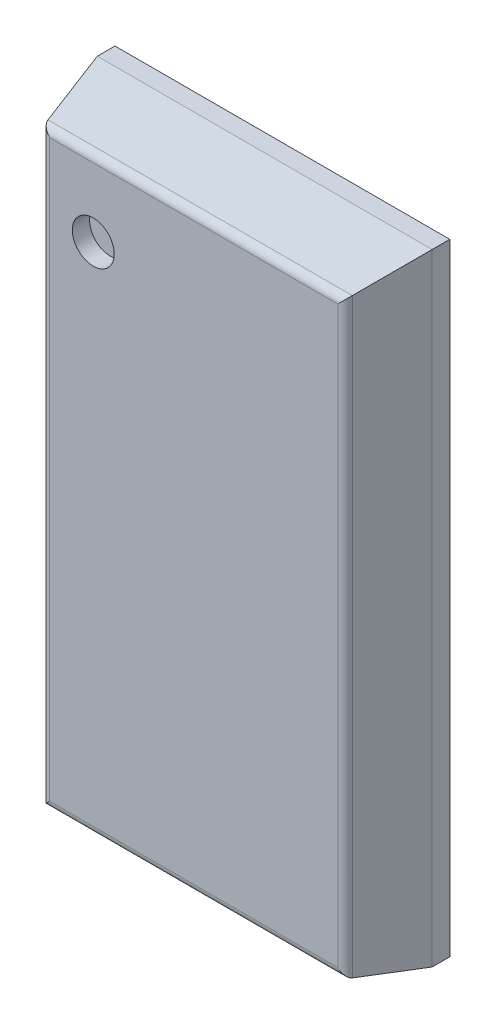
ISO-10303-21;
HEADER;
FILE_DESCRIPTION(('STEP AP214'),'2;1');
FILE_NAME('part.step','',(''),(''),'','','');
FILE_SCHEMA(('AUTOMOTIVE_DESIGN { 1 0 10303 214 1 1 1 1 }'));
ENDSEC;
DATA;
#1=APPLICATION_CONTEXT('core data for automotive mechanical design processes');
#2=APPLICATION_PROTOCOL_DEFINITION('international standard','automotive_design',2000,#1);
#3=PRODUCT_CONTEXT('',#1,'mechanical');
#4=PRODUCT('Part','Part','',(#3));
#5=PRODUCT_RELATED_PRODUCT_CATEGORY('part','',(#4));
#6=PRODUCT_DEFINITION_FORMATION('','',#4);
#7=PRODUCT_DEFINITION_CONTEXT('part definition',#1,'design');
#8=PRODUCT_DEFINITION('design','',#6,#7);
#9=PRODUCT_DEFINITION_SHAPE('','',#8);
#10=(LENGTH_UNIT() NAMED_UNIT(*) SI_UNIT(.MILLI.,.METRE.));
#11=(NAMED_UNIT(*) PLANE_ANGLE_UNIT() SI_UNIT($,.RADIAN.));
#12=(NAMED_UNIT(*) SI_UNIT($,.STERADIAN.) SOLID_ANGLE_UNIT());
#13=UNCERTAINTY_MEASURE_WITH_UNIT(LENGTH_MEASURE(1.E-05),#10,'distance_accuracy_value','');
#14=(GEOMETRIC_REPRESENTATION_CONTEXT(3) GLOBAL_UNCERTAINTY_ASSIGNED_CONTEXT((#13)) GLOBAL_UNIT_ASSIGNED_CONTEXT((#10,
#11,#12)) REPRESENTATION_CONTEXT('',''));
#15=CARTESIAN_POINT('',(0.,0.,0.));
#16=DIRECTION('',(0.,0.,1.));
#17=DIRECTION('',(1.,0.,0.));
#18=AXIS2_PLACEMENT_3D('',#15,#16,#17);
#19=CARTESIAN_POINT('',(-1.0515,2.29,1.62));
#20=DIRECTION('',(0.,0.,1.));
#21=DIRECTION('',(1.,0.,0.));
#22=AXIS2_PLACEMENT_3D('',#19,#20,#21);
#23=PLANE('',#22);
#24=CARTESIAN_POINT('',(-1.0515,2.29,1.62));
#25=DIRECTION('',(0.,0.,1.));
#26=DIRECTION('',(1.,0.,0.));
#27=AXIS2_PLACEMENT_3D('',#24,#25,#26);
#28=CIRCLE('',#27,0.2190625);
#29=CARTESIAN_POINT('',(-0.8324375,2.29,1.62));
#30=VERTEX_POINT('',#29);
#31=EDGE_CURVE('E25',#30,#30,#28,.T.);
#32=ORIENTED_EDGE('',*,*,#31,.T.);
#33=EDGE_LOOP('',(#32));
#34=FACE_BOUND('',#33,.T.);
#35=ADVANCED_FACE('F17',(#34),#23,.T.);
#36=CARTESIAN_POINT('',(-1.0515,2.29,1.62));
#37=DIRECTION('',(0.,0.,1.));
#38=DIRECTION('',(1.,0.,0.));
#39=AXIS2_PLACEMENT_3D('',#36,#37,#38);
#40=CYLINDRICAL_SURFACE('',#39,0.2190625);
#41=ORIENTED_EDGE('',*,*,#31,.F.);
#42=DIRECTION('',(0.,0.,1.));
#43=VECTOR('',#42,1.);
#44=CARTESIAN_POINT('',(-0.8324375,2.29,1.62));
#45=LINE('',#44,#43);
#46=CARTESIAN_POINT('',(-0.8324375,2.29,1.8));
#47=VERTEX_POINT('',#46);
#48=EDGE_CURVE('E11',#30,#47,#45,.T.);
#49=ORIENTED_EDGE('',*,*,#48,.T.);
#50=CARTESIAN_POINT('',(-1.0515,2.29,1.8));
#51=DIRECTION('',(0.,0.,1.));
#52=DIRECTION('',(1.,0.,0.));
#53=AXIS2_PLACEMENT_3D('',#50,#51,#52);
#54=CIRCLE('',#53,0.2190625);
#55=EDGE_CURVE('E213',#47,#47,#54,.T.);
#56=ORIENTED_EDGE('',*,*,#55,.T.);
#57=ORIENTED_EDGE('',*,*,#48,.F.);
#58=EDGE_LOOP('',(#41,#49,#56,#57));
#59=FACE_BOUND('',#58,.T.);
#60=ADVANCED_FACE('F334',(#59),#40,.F.);
#61=CARTESIAN_POINT('',(1.507884257852,-3.07725,1.712375));
#62=DIRECTION('',(0.,1.,0.));
#63=DIRECTION('',(0.,0.,1.));
#64=AXIS2_PLACEMENT_3D('',#61,#62,#63);
#65=CYLINDRICAL_SURFACE('',#64,0.087625);
#66=CARTESIAN_POINT('',(1.507884257852,-3.007884257852,1.712375));
#67=DIRECTION('',(-0.707106781186548,-0.707106781186548,0.));
#68=DIRECTION('',(0.707106781186548,-0.707106781186548,0.));
#69=AXIS2_PLACEMENT_3D('',#66,#67,#68);
#70=ELLIPSE('',#69,0.123920463403,0.087625);
#71=CARTESIAN_POINT('',(1.593170201742,-3.093170201742,1.732485902507));
#72=VERTEX_POINT('',#71);
#73=CARTESIAN_POINT('',(1.507884257852,-3.007884257852,1.8));
#74=VERTEX_POINT('',#73);
#75=EDGE_CURVE('E319',#72,#74,#70,.T.);
#76=ORIENTED_EDGE('',*,*,#75,.F.);
#77=DIRECTION('',(0.,1.,0.));
#78=VECTOR('',#77,1.);
#79=CARTESIAN_POINT('',(1.593170201742,-3.07725,1.732485902507));
#80=LINE('',#79,#78);
#81=CARTESIAN_POINT('',(1.593170201742,3.093170201742,1.732485902507));
#82=VERTEX_POINT('',#81);
#83=EDGE_CURVE('E209',#72,#82,#80,.T.);
#84=ORIENTED_EDGE('',*,*,#83,.T.);
#85=CARTESIAN_POINT('',(1.507884257852,3.007884257852,1.712375));
#86=DIRECTION('',(-0.707106781186548,0.707106781186548,0.));
#87=DIRECTION('',(0.707106781186548,0.707106781186548,0.));
#88=AXIS2_PLACEMENT_3D('',#85,#86,#87);
#89=ELLIPSE('',#88,0.123920463403,0.087625);
#90=CARTESIAN_POINT('',(1.507884257852,3.007884257852,1.8));
#91=VERTEX_POINT('',#90);
#92=EDGE_CURVE('E216',#91,#82,#89,.T.);
#93=ORIENTED_EDGE('',*,*,#92,.F.);
#94=DIRECTION('',(0.,1.,0.));
#95=VECTOR('',#94,1.);
#96=CARTESIAN_POINT('',(1.507884257852,-3.07725,1.8));
#97=LINE('',#96,#95);
#98=EDGE_CURVE('E224',#74,#91,#97,.T.);
#99=ORIENTED_EDGE('',*,*,#98,.F.);
#100=EDGE_LOOP('',(#76,#84,#93,#99));
#101=FACE_BOUND('',#100,.T.);
#102=ADVANCED_FACE('F336',(#101),#65,.T.);
#103=CARTESIAN_POINT('',(-1.57725,3.007884257852,1.712375));
#104=DIRECTION('',(1.,0.,0.));
#105=DIRECTION('',(0.,0.,1.));
#106=AXIS2_PLACEMENT_3D('',#103,#104,#105);
#107=CYLINDRICAL_SURFACE('',#106,0.087625);
#108=DIRECTION('',(1.,0.,0.));
#109=VECTOR('',#108,1.);
#110=CARTESIAN_POINT('',(-1.57725,3.007884257852,1.8));
#111=LINE('',#110,#109);
#112=CARTESIAN_POINT('',(-1.507884257852,3.007884257852,1.8));
#113=VERTEX_POINT('',#112);
#114=EDGE_CURVE('E217',#113,#91,#111,.T.);
#115=ORIENTED_EDGE('',*,*,#114,.T.);
#116=ORIENTED_EDGE('',*,*,#92,.T.);
#117=DIRECTION('',(1.,0.,0.));
#118=VECTOR('',#117,1.);
#119=CARTESIAN_POINT('',(-1.57725,3.093170201742,1.732485902507));
#120=LINE('',#119,#118);
#121=CARTESIAN_POINT('',(-1.593170201742,3.093170201742,1.732485902507));
#122=VERTEX_POINT('',#121);
#123=EDGE_CURVE('E210',#122,#82,#120,.T.);
#124=ORIENTED_EDGE('',*,*,#123,.F.);
#125=CARTESIAN_POINT('',(-1.507884257852,3.007884257852,1.712375));
#126=DIRECTION('',(0.707106781186548,0.707106781186548,0.));
#127=DIRECTION('',(-0.707106781186548,0.707106781186548,0.));
#128=AXIS2_PLACEMENT_3D('',#125,#126,#127);
#129=ELLIPSE('',#128,0.123920463403,0.087625);
#130=EDGE_CURVE('E229',#122,#113,#129,.T.);
#131=ORIENTED_EDGE('',*,*,#130,.T.);
#132=EDGE_LOOP('',(#115,#116,#124,#131));
#133=FACE_BOUND('',#132,.T.);
#134=ADVANCED_FACE('F343',(#133),#107,.T.);
#135=CARTESIAN_POINT('',(-1.7525,-3.2525,1.8));
#136=DIRECTION('',(0.,0.,1.));
#137=DIRECTION('',(1.,0.,0.));
#138=AXIS2_PLACEMENT_3D('',#135,#136,#137);
#139=PLANE('',#138);
#140=ORIENTED_EDGE('',*,*,#55,.F.);
#141=EDGE_LOOP('',(#140));
#142=FACE_BOUND('',#141,.T.);
#143=DIRECTION('',(0.,1.,0.));
#144=VECTOR('',#143,1.);
#145=CARTESIAN_POINT('',(-1.507884257852,-3.07725,1.8));
#146=LINE('',#145,#144);
#147=CARTESIAN_POINT('',(-1.507884257852,-3.007884257852,1.8));
#148=VERTEX_POINT('',#147);
#149=EDGE_CURVE('E233',#148,#113,#146,.T.);
#150=ORIENTED_EDGE('',*,*,#149,.F.);
#151=DIRECTION('',(1.,0.,0.));
#152=VECTOR('',#151,1.);
#153=CARTESIAN_POINT('',(-1.57725,-3.007884257852,1.8));
#154=LINE('',#153,#152);
#155=EDGE_CURVE('E228',#148,#74,#154,.T.);
#156=ORIENTED_EDGE('',*,*,#155,.T.);
#157=ORIENTED_EDGE('',*,*,#98,.T.);
#158=ORIENTED_EDGE('',*,*,#114,.F.);
#159=EDGE_LOOP('',(#150,#156,#157,#158));
#160=FACE_BOUND('',#159,.T.);
#161=ADVANCED_FACE('F400',(#142,#160),#139,.T.);
#162=CARTESIAN_POINT('',(-1.57725,-3.007884257852,1.712375));
#163=DIRECTION('',(1.,0.,0.));
#164=DIRECTION('',(0.,-0.973306064374652,0.229511012919918));
#165=AXIS2_PLACEMENT_3D('',#162,#163,#164);
#166=CYLINDRICAL_SURFACE('',#165,0.087625);
#167=DIRECTION('',(1.,0.,0.));
#168=VECTOR('',#167,1.);
#169=CARTESIAN_POINT('',(-1.57725,-3.093170201742,1.732485902507));
#170=LINE('',#169,#168);
#171=CARTESIAN_POINT('',(-1.593170201742,-3.093170201742,1.732485902507));
#172=VERTEX_POINT('',#171);
#173=EDGE_CURVE('E295',#172,#72,#170,.T.);
#174=ORIENTED_EDGE('',*,*,#173,.T.);
#175=ORIENTED_EDGE('',*,*,#75,.T.);
#176=ORIENTED_EDGE('',*,*,#155,.F.);
#177=CARTESIAN_POINT('',(-1.507884257852,-3.007884257852,1.712375));
#178=DIRECTION('',(-0.707106781186548,0.707106781186548,0.));
#179=DIRECTION('',(0.707106781186548,0.707106781186548,0.));
#180=AXIS2_PLACEMENT_3D('',#177,#178,#179);
#181=ELLIPSE('',#180,0.123920463403,0.087625);
#182=EDGE_CURVE('E312',#172,#148,#181,.T.);
#183=ORIENTED_EDGE('',*,*,#182,.F.);
#184=EDGE_LOOP('',(#174,#175,#176,#183));
#185=FACE_BOUND('',#184,.T.);
#186=ADVANCED_FACE('F396',(#185),#166,.T.);
#187=CARTESIAN_POINT('',(1.664875,-3.2525,1.42840151849));
#188=DIRECTION('',(0.973306064374652,0.,0.229511012919918));
#189=DIRECTION('',(0.,-1.,0.));
#190=AXIS2_PLACEMENT_3D('',#187,#188,#189);
#191=PLANE('',#190);
#192=DIRECTION('',(-0.223695018205087,0.223695018205087,0.948641701413369));
#193=VECTOR('',#192,1.);
#194=CARTESIAN_POINT('',(1.581565552085,-3.081565552085,1.781698686428));
#195=LINE('',#194,#193);
#196=CARTESIAN_POINT('',(1.7525,-3.2525,1.056803036979));
#197=VERTEX_POINT('',#196);
#198=EDGE_CURVE('E291',#197,#72,#195,.T.);
#199=ORIENTED_EDGE('',*,*,#198,.F.);
#200=DIRECTION('',(0.,1.,0.));
#201=VECTOR('',#200,1.);
#202=CARTESIAN_POINT('',(1.7525,-3.2525,1.056803036979));
#203=LINE('',#202,#201);
#204=CARTESIAN_POINT('',(1.7525,3.2525,1.056803036979));
#205=VERTEX_POINT('',#204);
#206=EDGE_CURVE('E296',#197,#205,#203,.T.);
#207=ORIENTED_EDGE('',*,*,#206,.T.);
#208=DIRECTION('',(-0.223695018205087,-0.223695018205087,0.948641701413369));
#209=VECTOR('',#208,1.);
#210=CARTESIAN_POINT('',(1.418812204631,2.918812204631,2.471900076154));
#211=LINE('',#210,#209);
#212=EDGE_CURVE('E205',#205,#82,#211,.T.);
#213=ORIENTED_EDGE('',*,*,#212,.T.);
#214=ORIENTED_EDGE('',*,*,#83,.F.);
#215=EDGE_LOOP('',(#199,#207,#213,#214));
#216=FACE_BOUND('',#215,.T.);
#217=ADVANCED_FACE('F393',(#216),#191,.T.);
#218=CARTESIAN_POINT('',(-1.7525,3.164875,1.42840151849));
#219=DIRECTION('',(0.,0.973306064374652,0.229511012919918));
#220=DIRECTION('',(1.,0.,0.));
#221=AXIS2_PLACEMENT_3D('',#218,#219,#220);
#222=PLANE('',#221);
#223=ORIENTED_EDGE('',*,*,#123,.T.);
#224=ORIENTED_EDGE('',*,*,#212,.F.);
#225=DIRECTION('',(1.,0.,0.));
#226=VECTOR('',#225,1.);
#227=CARTESIAN_POINT('',(-1.7525,3.2525,1.056803036979));
#228=LINE('',#227,#226);
#229=CARTESIAN_POINT('',(-1.7525,3.2525,1.056803036979));
#230=VERTEX_POINT('',#229);
#231=EDGE_CURVE('E259',#230,#205,#228,.T.);
#232=ORIENTED_EDGE('',*,*,#231,.F.);
#233=DIRECTION('',(0.223695018205087,-0.223695018205087,0.948641701413369));
#234=VECTOR('',#233,1.);
#235=CARTESIAN_POINT('',(-1.506506360331,3.006506360331,2.10000832043));
#236=LINE('',#235,#234);
#237=EDGE_CURVE('E290',#230,#122,#236,.T.);
#238=ORIENTED_EDGE('',*,*,#237,.T.);
#239=EDGE_LOOP('',(#223,#224,#232,#238));
#240=FACE_BOUND('',#239,.T.);
#241=ADVANCED_FACE('F391',(#240),#222,.T.);
#242=CARTESIAN_POINT('',(-1.507884257852,-3.07725,1.712375));
#243=DIRECTION('',(0.,1.,0.));
#244=DIRECTION('',(-0.973306064374652,0.,0.229511012919918));
#245=AXIS2_PLACEMENT_3D('',#242,#243,#244);
#246=CYLINDRICAL_SURFACE('',#245,0.087625);
#247=ORIENTED_EDGE('',*,*,#182,.T.);
#248=ORIENTED_EDGE('',*,*,#149,.T.);
#249=ORIENTED_EDGE('',*,*,#130,.F.);
#250=DIRECTION('',(0.,1.,0.));
#251=VECTOR('',#250,1.);
#252=CARTESIAN_POINT('',(-1.593170201742,-3.07725,1.732485902507));
#253=LINE('',#252,#251);
#254=EDGE_CURVE('E193',#172,#122,#253,.T.);
#255=ORIENTED_EDGE('',*,*,#254,.F.);
#256=EDGE_LOOP('',(#247,#248,#249,#255));
#257=FACE_BOUND('',#256,.T.);
#258=ADVANCED_FACE('F386',(#257),#246,.T.);
#259=CARTESIAN_POINT('',(-1.7525,-3.164875,1.42840151849));
#260=DIRECTION('',(0.,0.973306064374652,-0.229511012919918));
#261=DIRECTION('',(-1.,0.,0.));
#262=AXIS2_PLACEMENT_3D('',#259,#260,#261);
#263=PLANE('',#262);
#264=DIRECTION('',(0.223695018205087,0.223695018205087,0.948641701413369));
#265=VECTOR('',#264,1.);
#266=CARTESIAN_POINT('',(-1.669259707785,-3.169259707785,1.409806930703));
#267=LINE('',#266,#265);
#268=CARTESIAN_POINT('',(-1.7525,-3.2525,1.056803036979));
#269=VERTEX_POINT('',#268);
#270=EDGE_CURVE('E260',#269,#172,#267,.T.);
#271=ORIENTED_EDGE('',*,*,#270,.F.);
#272=DIRECTION('',(1.,0.,0.));
#273=VECTOR('',#272,1.);
#274=CARTESIAN_POINT('',(-1.7525,-3.2525,1.056803036979));
#275=LINE('',#274,#273);
#276=EDGE_CURVE('E147',#269,#197,#275,.T.);
#277=ORIENTED_EDGE('',*,*,#276,.T.);
#278=ORIENTED_EDGE('',*,*,#198,.T.);
#279=ORIENTED_EDGE('',*,*,#173,.F.);
#280=EDGE_LOOP('',(#271,#277,#278,#279));
#281=FACE_BOUND('',#280,.T.);
#282=ADVANCED_FACE('F365',(#281),#263,.F.);
#283=CARTESIAN_POINT('',(1.7525,-3.2525,0.74));
#284=DIRECTION('',(1.,0.,0.));
#285=DIRECTION('',(0.,1.,0.));
#286=AXIS2_PLACEMENT_3D('',#283,#284,#285);
#287=PLANE('',#286);
#288=DIRECTION('',(0.,0.,1.));
#289=VECTOR('',#288,1.);
#290=CARTESIAN_POINT('',(1.7525,-3.2525,0.74));
#291=LINE('',#290,#289);
#292=CARTESIAN_POINT('',(1.7525,-3.2525,0.871803036979));
#293=VERTEX_POINT('',#292);
#294=EDGE_CURVE('E266',#293,#197,#291,.T.);
#295=ORIENTED_EDGE('',*,*,#294,.F.);
#296=DIRECTION('',(0.,1.,0.));
#297=VECTOR('',#296,1.);
#298=CARTESIAN_POINT('',(1.7525,-3.2525,0.871803036979));
#299=LINE('',#298,#297);
#300=CARTESIAN_POINT('',(1.7525,3.2525,0.871803036979));
#301=VERTEX_POINT('',#300);
#302=EDGE_CURVE('E276',#293,#301,#299,.T.);
#303=ORIENTED_EDGE('',*,*,#302,.T.);
#304=DIRECTION('',(0.,0.,1.));
#305=VECTOR('',#304,1.);
#306=CARTESIAN_POINT('',(1.7525,3.2525,0.74));
#307=LINE('',#306,#305);
#308=EDGE_CURVE('E255',#301,#205,#307,.T.);
#309=ORIENTED_EDGE('',*,*,#308,.T.);
#310=ORIENTED_EDGE('',*,*,#206,.F.);
#311=EDGE_LOOP('',(#295,#303,#309,#310));
#312=FACE_BOUND('',#311,.T.);
#313=ADVANCED_FACE('F361',(#312),#287,.T.);
#314=CARTESIAN_POINT('',(1.547976732908,-3.07725,0.827625));
#315=DIRECTION('',(0.,1.,0.));
#316=DIRECTION('',(0.,0.,-1.));
#317=AXIS2_PLACEMENT_3D('',#314,#315,#316);
#318=CYLINDRICAL_SURFACE('',#317,0.087625);
#319=DIRECTION('',(0.,1.,0.));
#320=VECTOR('',#319,1.);
#321=CARTESIAN_POINT('',(1.547976732908,-3.07725,0.74));
#322=LINE('',#321,#320);
#323=CARTESIAN_POINT('',(1.547976732908,-3.047976732908,0.74));
#324=VERTEX_POINT('',#323);
#325=CARTESIAN_POINT('',(1.547976732908,3.047976732908,0.74));
#326=VERTEX_POINT('',#325);
#327=EDGE_CURVE('E194',#324,#326,#322,.T.);
#328=ORIENTED_EDGE('',*,*,#327,.T.);
#329=CARTESIAN_POINT('',(1.547976732908,3.047976732908,0.827625));
#330=DIRECTION('',(0.707106781186548,-0.707106781186548,0.));
#331=DIRECTION('',(0.707106781186548,0.707106781186548,0.));
#332=AXIS2_PLACEMENT_3D('',#329,#330,#331);
#333=ELLIPSE('',#332,0.123920463403,0.087625);
#334=CARTESIAN_POINT('',(1.600645169946,3.100645169946,0.757595175176));
#335=VERTEX_POINT('',#334);
#336=EDGE_CURVE('E191',#326,#335,#333,.T.);
#337=ORIENTED_EDGE('',*,*,#336,.T.);
#338=DIRECTION('',(0.,1.,0.));
#339=VECTOR('',#338,1.);
#340=CARTESIAN_POINT('',(1.600645169946,-3.07725,0.757595175176));
#341=LINE('',#340,#339);
#342=CARTESIAN_POINT('',(1.600645169946,-3.100645169946,0.757595175176));
#343=VERTEX_POINT('',#342);
#344=EDGE_CURVE('E269',#343,#335,#341,.T.);
#345=ORIENTED_EDGE('',*,*,#344,.F.);
#346=CARTESIAN_POINT('',(1.547976732908,-3.047976732908,0.827625));
#347=DIRECTION('',(0.707106781186548,0.707106781186548,0.));
#348=DIRECTION('',(0.707106781186548,-0.707106781186548,0.));
#349=AXIS2_PLACEMENT_3D('',#346,#347,#348);
#350=ELLIPSE('',#349,0.123920463403,0.087625);
#351=EDGE_CURVE('E246',#343,#324,#350,.T.);
#352=ORIENTED_EDGE('',*,*,#351,.T.);
#353=EDGE_LOOP('',(#328,#337,#345,#352));
#354=FACE_BOUND('',#353,.T.);
#355=ADVANCED_FACE('F364',(#354),#318,.T.);
#356=CARTESIAN_POINT('',(-1.7525,3.2525,0.74));
#357=DIRECTION('',(0.,1.,0.));
#358=DIRECTION('',(1.,0.,0.));
#359=AXIS2_PLACEMENT_3D('',#356,#357,#358);
#360=PLANE('',#359);
#361=ORIENTED_EDGE('',*,*,#308,.F.);
#362=DIRECTION('',(1.,0.,0.));
#363=VECTOR('',#362,1.);
#364=CARTESIAN_POINT('',(-1.7525,3.2525,0.871803036979));
#365=LINE('',#364,#363);
#366=CARTESIAN_POINT('',(-1.7525,3.2525,0.871803036979));
#367=VERTEX_POINT('',#366);
#368=EDGE_CURVE('E153',#367,#301,#365,.T.);
#369=ORIENTED_EDGE('',*,*,#368,.F.);
#370=DIRECTION('',(0.,0.,1.));
#371=VECTOR('',#370,1.);
#372=CARTESIAN_POINT('',(-1.7525,3.2525,0.74));
#373=LINE('',#372,#371);
#374=EDGE_CURVE('E154',#367,#230,#373,.T.);
#375=ORIENTED_EDGE('',*,*,#374,.T.);
#376=ORIENTED_EDGE('',*,*,#231,.T.);
#377=EDGE_LOOP('',(#361,#369,#375,#376));
#378=FACE_BOUND('',#377,.T.);
#379=ADVANCED_FACE('F377',(#378),#360,.T.);
#380=CARTESIAN_POINT('',(-1.664875,-3.2525,1.42840151849));
#381=DIRECTION('',(0.973306064374652,0.,-0.229511012919918));
#382=DIRECTION('',(0.,-1.,0.));
#383=AXIS2_PLACEMENT_3D('',#380,#381,#382);
#384=PLANE('',#383);
#385=ORIENTED_EDGE('',*,*,#254,.T.);
#386=ORIENTED_EDGE('',*,*,#237,.F.);
#387=DIRECTION('',(0.,1.,0.));
#388=VECTOR('',#387,1.);
#389=CARTESIAN_POINT('',(-1.7525,-3.2525,1.056803036979));
#390=LINE('',#389,#388);
#391=EDGE_CURVE('E240',#269,#230,#390,.T.);
#392=ORIENTED_EDGE('',*,*,#391,.F.);
#393=ORIENTED_EDGE('',*,*,#270,.T.);
#394=EDGE_LOOP('',(#385,#386,#392,#393));
#395=FACE_BOUND('',#394,.T.);
#396=ADVANCED_FACE('F373',(#395),#384,.F.);
#397=CARTESIAN_POINT('',(-1.57725,3.047976732908,0.827625));
#398=DIRECTION('',(1.,0.,0.));
#399=DIRECTION('',(0.,0.,-1.));
#400=AXIS2_PLACEMENT_3D('',#397,#398,#399);
#401=CYLINDRICAL_SURFACE('',#400,0.087625);
#402=CARTESIAN_POINT('',(-1.547976732908,3.047976732908,0.827625));
#403=DIRECTION('',(-0.707106781186548,-0.707106781186548,0.));
#404=DIRECTION('',(-0.707106781186548,0.707106781186548,0.));
#405=AXIS2_PLACEMENT_3D('',#402,#403,#404);
#406=ELLIPSE('',#405,0.123920463403,0.087625);
#407=CARTESIAN_POINT('',(-1.600645169946,3.100645169946,0.757595175176));
#408=VERTEX_POINT('',#407);
#409=CARTESIAN_POINT('',(-1.547976732908,3.047976732908,0.74));
#410=VERTEX_POINT('',#409);
#411=EDGE_CURVE('E165',#408,#410,#406,.T.);
#412=ORIENTED_EDGE('',*,*,#411,.F.);
#413=DIRECTION('',(1.,0.,0.));
#414=VECTOR('',#413,1.);
#415=CARTESIAN_POINT('',(-1.57725,3.100645169946,0.757595175176));
#416=LINE('',#415,#414);
#417=EDGE_CURVE('E218',#408,#335,#416,.T.);
#418=ORIENTED_EDGE('',*,*,#417,.T.);
#419=ORIENTED_EDGE('',*,*,#336,.F.);
#420=DIRECTION('',(1.,0.,0.));
#421=VECTOR('',#420,1.);
#422=CARTESIAN_POINT('',(-1.57725,3.047976732908,0.74));
#423=LINE('',#422,#421);
#424=EDGE_CURVE('E280',#410,#326,#423,.T.);
#425=ORIENTED_EDGE('',*,*,#424,.F.);
#426=EDGE_LOOP('',(#412,#418,#419,#425));
#427=FACE_BOUND('',#426,.T.);
#428=ADVANCED_FACE('F369',(#427),#401,.T.);
#429=CARTESIAN_POINT('',(-1.7525,-3.2525,0.74));
#430=DIRECTION('',(0.,0.,1.));
#431=DIRECTION('',(1.,0.,0.));
#432=AXIS2_PLACEMENT_3D('',#429,#430,#431);
#433=PLANE('',#432);
#434=ORIENTED_EDGE('',*,*,#424,.T.);
#435=ORIENTED_EDGE('',*,*,#327,.F.);
#436=DIRECTION('',(1.,0.,0.));
#437=VECTOR('',#436,1.);
#438=CARTESIAN_POINT('',(-1.57725,-3.047976732908,0.74));
#439=LINE('',#438,#437);
#440=CARTESIAN_POINT('',(-1.547976732908,-3.047976732908,0.74));
#441=VERTEX_POINT('',#440);
#442=EDGE_CURVE('E222',#441,#324,#439,.T.);
#443=ORIENTED_EDGE('',*,*,#442,.F.);
#444=DIRECTION('',(0.,1.,0.));
#445=VECTOR('',#444,1.);
#446=CARTESIAN_POINT('',(-1.547976732908,-3.07725,0.74));
#447=LINE('',#446,#445);
#448=EDGE_CURVE('E198',#441,#410,#447,.T.);
#449=ORIENTED_EDGE('',*,*,#448,.T.);
#450=EDGE_LOOP('',(#434,#435,#443,#449));
#451=FACE_BOUND('',#450,.T.);
#452=ADVANCED_FACE('F353',(#451),#433,.F.);
#453=CARTESIAN_POINT('',(1.664875,-3.2525,0.80590151849));
#454=DIRECTION('',(-0.601066328540768,0.,0.799199142075692));
#455=DIRECTION('',(0.,1.,0.));
#456=AXIS2_PLACEMENT_3D('',#453,#454,#455);
#457=PLANE('',#456);
#458=ORIENTED_EDGE('',*,*,#344,.T.);
#459=DIRECTION('',(-0.624313503926429,-0.624313503926429,-0.469537322936323));
#460=VECTOR('',#459,1.);
#461=CARTESIAN_POINT('',(-0.251757228533,1.248242771467,-0.635570370199));
#462=LINE('',#461,#460);
#463=EDGE_CURVE('E223',#301,#335,#462,.T.);
#464=ORIENTED_EDGE('',*,*,#463,.F.);
#465=ORIENTED_EDGE('',*,*,#302,.F.);
#466=DIRECTION('',(-0.624313503926429,0.624313503926429,-0.469537322936323));
#467=VECTOR('',#466,1.);
#468=CARTESIAN_POINT('',(1.015961081196,-2.515961081196,0.317862572775));
#469=LINE('',#468,#467);
#470=EDGE_CURVE('E163',#293,#343,#469,.T.);
#471=ORIENTED_EDGE('',*,*,#470,.T.);
#472=EDGE_LOOP('',(#458,#464,#465,#471));
#473=FACE_BOUND('',#472,.T.);
#474=ADVANCED_FACE('F350',(#473),#457,.F.);
#475=CARTESIAN_POINT('',(-1.7525,-3.2525,0.74));
#476=DIRECTION('',(0.,1.,0.));
#477=DIRECTION('',(1.,0.,0.));
#478=AXIS2_PLACEMENT_3D('',#475,#476,#477);
#479=PLANE('',#478);
#480=ORIENTED_EDGE('',*,*,#276,.F.);
#481=DIRECTION('',(0.,0.,1.));
#482=VECTOR('',#481,1.);
#483=CARTESIAN_POINT('',(-1.7525,-3.2525,0.74));
#484=LINE('',#483,#482);
#485=CARTESIAN_POINT('',(-1.7525,-3.2525,0.871803036979));
#486=VERTEX_POINT('',#485);
#487=EDGE_CURVE('E140',#486,#269,#484,.T.);
#488=ORIENTED_EDGE('',*,*,#487,.F.);
#489=DIRECTION('',(1.,0.,0.));
#490=VECTOR('',#489,1.);
#491=CARTESIAN_POINT('',(-1.7525,-3.2525,0.871803036979));
#492=LINE('',#491,#490);
#493=EDGE_CURVE('E144',#486,#293,#492,.T.);
#494=ORIENTED_EDGE('',*,*,#493,.T.);
#495=ORIENTED_EDGE('',*,*,#294,.T.);
#496=EDGE_LOOP('',(#480,#488,#494,#495));
#497=FACE_BOUND('',#496,.T.);
#498=ADVANCED_FACE('F142',(#497),#479,.F.);
#499=CARTESIAN_POINT('',(-1.57725,-3.047976732908,0.827625));
#500=DIRECTION('',(1.,0.,0.));
#501=DIRECTION('',(0.,-0.601066328540768,-0.799199142075692));
#502=AXIS2_PLACEMENT_3D('',#499,#500,#501);
#503=CYLINDRICAL_SURFACE('',#502,0.087625);
#504=CARTESIAN_POINT('',(-1.547976732908,-3.047976732908,0.827625));
#505=DIRECTION('',(0.707106781186548,-0.707106781186548,0.));
#506=DIRECTION('',(0.707106781186548,0.707106781186548,0.));
#507=AXIS2_PLACEMENT_3D('',#504,#505,#506);
#508=ELLIPSE('',#507,0.123920463403,0.087625);
#509=CARTESIAN_POINT('',(-1.600645169946,-3.100645169946,0.757595175176));
#510=VERTEX_POINT('',#509);
#511=EDGE_CURVE('E202',#510,#441,#508,.T.);
#512=ORIENTED_EDGE('',*,*,#511,.T.);
#513=ORIENTED_EDGE('',*,*,#442,.T.);
#514=ORIENTED_EDGE('',*,*,#351,.F.);
#515=DIRECTION('',(1.,0.,0.));
#516=VECTOR('',#515,1.);
#517=CARTESIAN_POINT('',(-1.57725,-3.100645169946,0.757595175176));
#518=LINE('',#517,#516);
#519=EDGE_CURVE('E189',#510,#343,#518,.T.);
#520=ORIENTED_EDGE('',*,*,#519,.F.);
#521=EDGE_LOOP('',(#512,#513,#514,#520));
#522=FACE_BOUND('',#521,.T.);
#523=ADVANCED_FACE('F355',(#522),#503,.T.);
#524=CARTESIAN_POINT('',(-1.7525,3.164875,0.80590151849));
#525=DIRECTION('',(0.,-0.601066328540768,0.799199142075692));
#526=DIRECTION('',(-1.,0.,0.));
#527=AXIS2_PLACEMENT_3D('',#524,#525,#526);
#528=PLANE('',#527);
#529=DIRECTION('',(0.624313503926429,-0.624313503926429,-0.469537322936323));
#530=VECTOR('',#529,1.);
#531=CARTESIAN_POINT('',(-0.431310054419,1.931310054419,-0.121845164185));
#532=LINE('',#531,#530);
#533=EDGE_CURVE('E176',#367,#408,#532,.T.);
#534=ORIENTED_EDGE('',*,*,#533,.F.);
#535=ORIENTED_EDGE('',*,*,#368,.T.);
#536=ORIENTED_EDGE('',*,*,#463,.T.);
#537=ORIENTED_EDGE('',*,*,#417,.F.);
#538=EDGE_LOOP('',(#534,#535,#536,#537));
#539=FACE_BOUND('',#538,.T.);
#540=ADVANCED_FACE('F348',(#539),#528,.F.);
#541=CARTESIAN_POINT('',(-1.7525,-3.2525,0.74));
#542=DIRECTION('',(1.,0.,0.));
#543=DIRECTION('',(0.,1.,0.));
#544=AXIS2_PLACEMENT_3D('',#541,#542,#543);
#545=PLANE('',#544);
#546=ORIENTED_EDGE('',*,*,#391,.T.);
#547=ORIENTED_EDGE('',*,*,#374,.F.);
#548=DIRECTION('',(0.,1.,0.));
#549=VECTOR('',#548,1.);
#550=CARTESIAN_POINT('',(-1.7525,-3.2525,0.871803036979));
#551=LINE('',#550,#549);
#552=EDGE_CURVE('E169',#486,#367,#551,.T.);
#553=ORIENTED_EDGE('',*,*,#552,.F.);
#554=ORIENTED_EDGE('',*,*,#487,.T.);
#555=EDGE_LOOP('',(#546,#547,#553,#554));
#556=FACE_BOUND('',#555,.T.);
#557=ADVANCED_FACE('F170',(#556),#545,.F.);
#558=CARTESIAN_POINT('',(-1.547976732908,-3.07725,0.827625));
#559=DIRECTION('',(0.,1.,0.));
#560=DIRECTION('',(-0.601066328540768,0.,-0.799199142075692));
#561=AXIS2_PLACEMENT_3D('',#558,#559,#560);
#562=CYLINDRICAL_SURFACE('',#561,0.087625);
#563=DIRECTION('',(0.,1.,0.));
#564=VECTOR('',#563,1.);
#565=CARTESIAN_POINT('',(-1.600645169946,-3.07725,0.757595175176));
#566=LINE('',#565,#564);
#567=EDGE_CURVE('E181',#510,#408,#566,.T.);
#568=ORIENTED_EDGE('',*,*,#567,.T.);
#569=ORIENTED_EDGE('',*,*,#411,.T.);
#570=ORIENTED_EDGE('',*,*,#448,.F.);
#571=ORIENTED_EDGE('',*,*,#511,.F.);
#572=EDGE_LOOP('',(#568,#569,#570,#571));
#573=FACE_BOUND('',#572,.T.);
#574=ADVANCED_FACE('F563',(#573),#562,.T.);
#575=CARTESIAN_POINT('',(-1.7525,-3.164875,0.80590151849));
#576=DIRECTION('',(0.,-0.601066328540768,-0.799199142075692));
#577=DIRECTION('',(0.,-0.799199142075692,0.601066328540768));
#578=AXIS2_PLACEMENT_3D('',#575,#576,#577);
#579=PLANE('',#578);
#580=ORIENTED_EDGE('',*,*,#519,.T.);
#581=ORIENTED_EDGE('',*,*,#470,.F.);
#582=ORIENTED_EDGE('',*,*,#493,.F.);
#583=DIRECTION('',(0.624313503926429,0.624313503926429,-0.469537322936323));
#584=VECTOR('',#583,1.);
#585=CARTESIAN_POINT('',(-1.699028364148,-3.199028364148,0.83158777879));
#586=LINE('',#585,#584);
#587=EDGE_CURVE('E161',#486,#510,#586,.T.);
#588=ORIENTED_EDGE('',*,*,#587,.T.);
#589=EDGE_LOOP('',(#580,#581,#582,#588));
#590=FACE_BOUND('',#589,.T.);
#591=ADVANCED_FACE('F159',(#590),#579,.T.);
#592=CARTESIAN_POINT('',(-1.664875,-3.2525,0.80590151849));
#593=DIRECTION('',(-0.601066328540768,0.,-0.799199142075692));
#594=DIRECTION('',(-0.799199142075692,0.,0.601066328540768));
#595=AXIS2_PLACEMENT_3D('',#592,#593,#594);
#596=PLANE('',#595);
#597=ORIENTED_EDGE('',*,*,#587,.F.);
#598=ORIENTED_EDGE('',*,*,#552,.T.);
#599=ORIENTED_EDGE('',*,*,#533,.T.);
#600=ORIENTED_EDGE('',*,*,#567,.F.);
#601=EDGE_LOOP('',(#597,#598,#599,#600));
#602=FACE_BOUND('',#601,.T.);
#603=ADVANCED_FACE('F179',(#602),#596,.T.);
#604=CLOSED_SHELL('',(#35,#60,#102,#134,#161,#186,#217,#241,#258,#282,#313,#355,#379,#396,#428,
#452,#474,#498,#523,#540,#557,#574,#591,#603));
#605=MANIFOLD_SOLID_BREP('B1',#604);
#606=ADVANCED_BREP_SHAPE_REPRESENTATION('',(#18,#605),#14);
#607=SHAPE_DEFINITION_REPRESENTATION(#9,#606);
ENDSEC;
END-ISO-10303-21;
